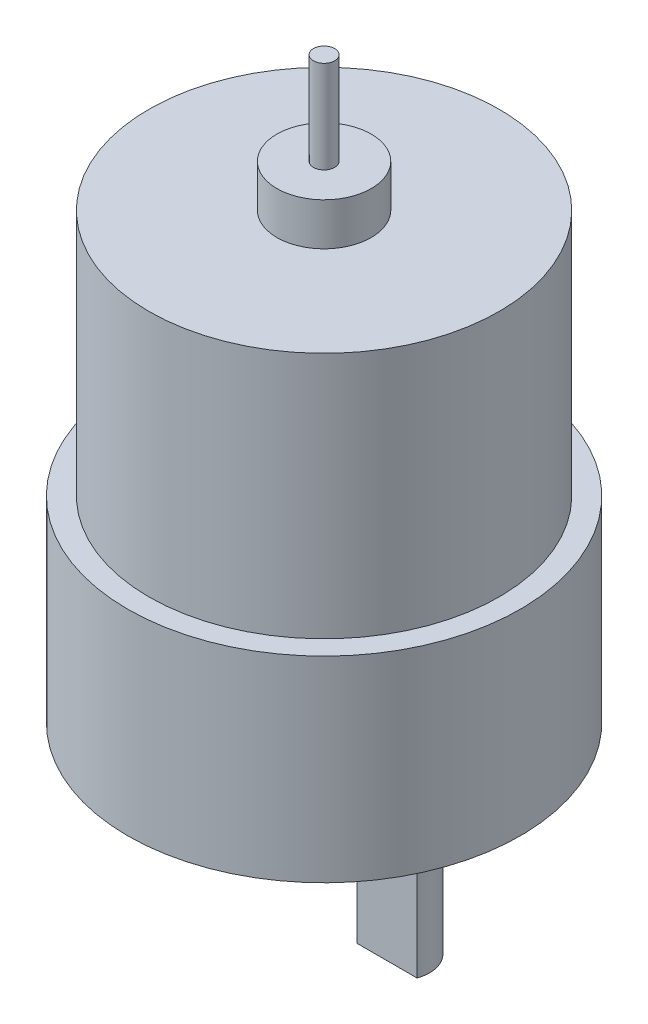
ISO-10303-21;
HEADER;
FILE_DESCRIPTION(('STEP AP214'),'2;1');
FILE_NAME('part.step','',(''),(''),'','','');
FILE_SCHEMA(('AUTOMOTIVE_DESIGN { 1 0 10303 214 1 1 1 1 }'));
ENDSEC;
DATA;
#1=APPLICATION_CONTEXT('core data for automotive mechanical design processes');
#2=APPLICATION_PROTOCOL_DEFINITION('international standard','automotive_design',2000,#1);
#3=PRODUCT_CONTEXT('',#1,'mechanical');
#4=PRODUCT('Part','Part','',(#3));
#5=PRODUCT_RELATED_PRODUCT_CATEGORY('part','',(#4));
#6=PRODUCT_DEFINITION_FORMATION('','',#4);
#7=PRODUCT_DEFINITION_CONTEXT('part definition',#1,'design');
#8=PRODUCT_DEFINITION('design','',#6,#7);
#9=PRODUCT_DEFINITION_SHAPE('','',#8);
#10=(LENGTH_UNIT() NAMED_UNIT(*) SI_UNIT(.MILLI.,.METRE.));
#11=(NAMED_UNIT(*) PLANE_ANGLE_UNIT() SI_UNIT($,.RADIAN.));
#12=(NAMED_UNIT(*) SI_UNIT($,.STERADIAN.) SOLID_ANGLE_UNIT());
#13=UNCERTAINTY_MEASURE_WITH_UNIT(LENGTH_MEASURE(1.E-05),#10,'distance_accuracy_value','');
#14=(GEOMETRIC_REPRESENTATION_CONTEXT(3) GLOBAL_UNCERTAINTY_ASSIGNED_CONTEXT((#13)) GLOBAL_UNIT_ASSIGNED_CONTEXT((#10,
#11,#12)) REPRESENTATION_CONTEXT('',''));
#15=CARTESIAN_POINT('',(0.,0.,0.));
#16=DIRECTION('',(0.,0.,1.));
#17=DIRECTION('',(1.,0.,0.));
#18=AXIS2_PLACEMENT_3D('',#15,#16,#17);
#19=CARTESIAN_POINT('',(0.,36.5374,0.));
#20=DIRECTION('',(0.,1.,0.));
#21=DIRECTION('',(0.,0.,1.));
#22=AXIS2_PLACEMENT_3D('',#19,#20,#21);
#23=PLANE('',#22);
#24=CARTESIAN_POINT('',(0.,36.5374,0.));
#25=DIRECTION('',(0.,1.,0.));
#26=DIRECTION('',(0.,0.,1.));
#27=AXIS2_PLACEMENT_3D('',#24,#25,#26);
#28=CIRCLE('',#27,4.445);
#29=CARTESIAN_POINT('',(0.,36.5374,4.44500000000001));
#30=VERTEX_POINT('',#29);
#31=EDGE_CURVE('E275',#30,#30,#28,.T.);
#32=ORIENTED_EDGE('',*,*,#31,.T.);
#33=EDGE_LOOP('',(#32));
#34=FACE_BOUND('',#33,.T.);
#35=CARTESIAN_POINT('',(0.,36.5374,0.));
#36=DIRECTION('',(0.,1.,0.));
#37=DIRECTION('',(0.,0.,1.));
#38=AXIS2_PLACEMENT_3D('',#35,#36,#37);
#39=CIRCLE('',#38,1.);
#40=CARTESIAN_POINT('',(0.,36.5374,1.00000000000001));
#41=VERTEX_POINT('',#40);
#42=EDGE_CURVE('E272',#41,#41,#39,.T.);
#43=ORIENTED_EDGE('',*,*,#42,.F.);
#44=EDGE_LOOP('',(#43));
#45=FACE_BOUND('',#44,.T.);
#46=ADVANCED_FACE('F34',(#34,#45),#23,.T.);
#47=CARTESIAN_POINT('',(0.,32.5374,0.));
#48=DIRECTION('',(0.,1.,0.));
#49=DIRECTION('',(0.,0.,1.));
#50=AXIS2_PLACEMENT_3D('',#47,#48,#49);
#51=PLANE('',#50);
#52=CARTESIAN_POINT('',(0.,32.5374,0.));
#53=DIRECTION('',(0.,1.,0.));
#54=DIRECTION('',(0.,0.,1.));
#55=AXIS2_PLACEMENT_3D('',#52,#53,#54);
#56=CIRCLE('',#55,16.5);
#57=CARTESIAN_POINT('',(0.,32.5374,16.5));
#58=VERTEX_POINT('',#57);
#59=EDGE_CURVE('E66',#58,#58,#56,.T.);
#60=ORIENTED_EDGE('',*,*,#59,.T.);
#61=EDGE_LOOP('',(#60));
#62=FACE_BOUND('',#61,.T.);
#63=CARTESIAN_POINT('',(0.,32.5374,0.));
#64=DIRECTION('',(0.,1.,0.));
#65=DIRECTION('',(0.,0.,1.));
#66=AXIS2_PLACEMENT_3D('',#63,#64,#65);
#67=CIRCLE('',#66,4.445);
#68=CARTESIAN_POINT('',(0.,32.5374,4.44500000000001));
#69=VERTEX_POINT('',#68);
#70=EDGE_CURVE('E271',#69,#69,#67,.T.);
#71=ORIENTED_EDGE('',*,*,#70,.F.);
#72=EDGE_LOOP('',(#71));
#73=FACE_BOUND('',#72,.T.);
#74=ADVANCED_FACE('F105',(#62,#73),#51,.T.);
#75=CARTESIAN_POINT('',(0.,9.2456,0.));
#76=DIRECTION('',(0.,1.,0.));
#77=DIRECTION('',(0.,0.,1.));
#78=AXIS2_PLACEMENT_3D('',#75,#76,#77);
#79=PLANE('',#78);
#80=CARTESIAN_POINT('',(0.,9.2456,0.));
#81=DIRECTION('',(0.,1.,0.));
#82=DIRECTION('',(0.,0.,1.));
#83=AXIS2_PLACEMENT_3D('',#80,#81,#82);
#84=CIRCLE('',#83,18.5);
#85=CARTESIAN_POINT('',(0.,9.2456,18.5));
#86=VERTEX_POINT('',#85);
#87=EDGE_CURVE('E42',#86,#86,#84,.T.);
#88=ORIENTED_EDGE('',*,*,#87,.T.);
#89=EDGE_LOOP('',(#88));
#90=FACE_BOUND('',#89,.T.);
#91=CARTESIAN_POINT('',(0.,9.2456,0.));
#92=DIRECTION('',(0.,1.,0.));
#93=DIRECTION('',(0.,0.,1.));
#94=AXIS2_PLACEMENT_3D('',#91,#92,#93);
#95=CIRCLE('',#94,16.5);
#96=CARTESIAN_POINT('',(0.,9.2456,16.5));
#97=VERTEX_POINT('',#96);
#98=EDGE_CURVE('E283',#97,#97,#95,.T.);
#99=ORIENTED_EDGE('',*,*,#98,.F.);
#100=EDGE_LOOP('',(#99));
#101=FACE_BOUND('',#100,.T.);
#102=ADVANCED_FACE('F89',(#90,#101),#79,.T.);
#103=CARTESIAN_POINT('',(0.,-13.8176,-6.95));
#104=DIRECTION('',(0.,-1.,0.));
#105=DIRECTION('',(0.,0.,-1.));
#106=AXIS2_PLACEMENT_3D('',#103,#104,#105);
#107=PLANE('',#106);
#108=CARTESIAN_POINT('',(0.,-13.8176,-6.95));
#109=DIRECTION('',(0.,-1.,0.));
#110=DIRECTION('',(0.,0.,-1.));
#111=AXIS2_PLACEMENT_3D('',#108,#109,#110);
#112=CIRCLE('',#111,6.);
#113=CARTESIAN_POINT('',(0.,-13.8176,-12.95));
#114=VERTEX_POINT('',#113);
#115=EDGE_CURVE('E79',#114,#114,#112,.T.);
#116=ORIENTED_EDGE('',*,*,#115,.T.);
#117=EDGE_LOOP('',(#116));
#118=FACE_BOUND('',#117,.T.);
#119=CARTESIAN_POINT('',(0.,-13.8176,-6.95));
#120=DIRECTION('',(0.,-1.,0.));
#121=DIRECTION('',(0.,0.,-1.));
#122=AXIS2_PLACEMENT_3D('',#119,#120,#121);
#123=CIRCLE('',#122,3.);
#124=CARTESIAN_POINT('',(0.,-13.8176,-9.95));
#125=VERTEX_POINT('',#124);
#126=EDGE_CURVE('E73',#125,#125,#123,.T.);
#127=ORIENTED_EDGE('',*,*,#126,.F.);
#128=EDGE_LOOP('',(#127));
#129=FACE_BOUND('',#128,.T.);
#130=ADVANCED_FACE('F102',(#118,#129),#107,.T.);
#131=CARTESIAN_POINT('',(18.5,-9.2456,0.));
#132=DIRECTION('',(0.,-1.,0.));
#133=DIRECTION('',(0.,0.,-1.));
#134=AXIS2_PLACEMENT_3D('',#131,#132,#133);
#135=PLANE('',#134);
#136=CARTESIAN_POINT('',(-13.8545119004604,-9.2456,-6.95));
#137=DIRECTION('',(0.,-1.,0.));
#138=DIRECTION('',(0.,0.,-1.));
#139=AXIS2_PLACEMENT_3D('',#136,#137,#138);
#140=CIRCLE('',#139,1.49999999999999);
#141=CARTESIAN_POINT('',(-13.8545119004604,-9.2456,-8.44999999999999));
#142=VERTEX_POINT('',#141);
#143=EDGE_CURVE('E335',#142,#142,#140,.T.);
#144=ORIENTED_EDGE('',*,*,#143,.F.);
#145=EDGE_LOOP('',(#144));
#146=FACE_BOUND('',#145,.T.);
#147=CARTESIAN_POINT('',(13.8545119004604,-9.2456,-6.95));
#148=DIRECTION('',(0.,-1.,0.));
#149=DIRECTION('',(0.,0.,-1.));
#150=AXIS2_PLACEMENT_3D('',#147,#148,#149);
#151=CIRCLE('',#150,1.49999999999999);
#152=CARTESIAN_POINT('',(13.8545119004604,-9.2456,-8.44999999999999));
#153=VERTEX_POINT('',#152);
#154=EDGE_CURVE('E329',#153,#153,#151,.T.);
#155=ORIENTED_EDGE('',*,*,#154,.F.);
#156=EDGE_LOOP('',(#155));
#157=FACE_BOUND('',#156,.T.);
#158=CARTESIAN_POINT('',(0.,-9.2456,15.5));
#159=DIRECTION('',(0.,-1.,0.));
#160=DIRECTION('',(0.,0.,-1.));
#161=AXIS2_PLACEMENT_3D('',#158,#159,#160);
#162=CIRCLE('',#161,1.49999999999999);
#163=CARTESIAN_POINT('',(0.,-9.2456,14.));
#164=VERTEX_POINT('',#163);
#165=EDGE_CURVE('E323',#164,#164,#162,.T.);
#166=ORIENTED_EDGE('',*,*,#165,.F.);
#167=EDGE_LOOP('',(#166));
#168=FACE_BOUND('',#167,.T.);
#169=CARTESIAN_POINT('',(-15.5,-9.2456,0.));
#170=DIRECTION('',(0.,-1.,0.));
#171=DIRECTION('',(0.,0.,-1.));
#172=AXIS2_PLACEMENT_3D('',#169,#170,#171);
#173=CIRCLE('',#172,1.49999999999999);
#174=CARTESIAN_POINT('',(-15.5,-9.2456,-1.49999999999999));
#175=VERTEX_POINT('',#174);
#176=EDGE_CURVE('E317',#175,#175,#173,.T.);
#177=ORIENTED_EDGE('',*,*,#176,.F.);
#178=EDGE_LOOP('',(#177));
#179=FACE_BOUND('',#178,.T.);
#180=CARTESIAN_POINT('',(-7.75,-9.2456,13.4233937586588));
#181=DIRECTION('',(0.,-1.,0.));
#182=DIRECTION('',(0.,0.,-1.));
#183=AXIS2_PLACEMENT_3D('',#180,#181,#182);
#184=CIRCLE('',#183,1.49999999999999);
#185=CARTESIAN_POINT('',(-7.75,-9.2456,11.9233937586588));
#186=VERTEX_POINT('',#185);
#187=EDGE_CURVE('E311',#186,#186,#184,.T.);
#188=ORIENTED_EDGE('',*,*,#187,.F.);
#189=EDGE_LOOP('',(#188));
#190=FACE_BOUND('',#189,.T.);
#191=CARTESIAN_POINT('',(15.5,-9.2456,0.));
#192=DIRECTION('',(0.,-1.,0.));
#193=DIRECTION('',(0.,0.,-1.));
#194=AXIS2_PLACEMENT_3D('',#191,#192,#193);
#195=CIRCLE('',#194,1.49999999999999);
#196=CARTESIAN_POINT('',(15.5,-9.2456,-1.49999999999998));
#197=VERTEX_POINT('',#196);
#198=EDGE_CURVE('E305',#197,#197,#195,.T.);
#199=ORIENTED_EDGE('',*,*,#198,.F.);
#200=EDGE_LOOP('',(#199));
#201=FACE_BOUND('',#200,.T.);
#202=CARTESIAN_POINT('',(-7.74999999999999,-9.2456,-13.4233937586588));
#203=DIRECTION('',(0.,-1.,0.));
#204=DIRECTION('',(0.,0.,-1.));
#205=AXIS2_PLACEMENT_3D('',#202,#203,#204);
#206=CIRCLE('',#205,1.49999999999999);
#207=CARTESIAN_POINT('',(-7.74999999999999,-9.2456,-14.9233937586588));
#208=VERTEX_POINT('',#207);
#209=EDGE_CURVE('E299',#208,#208,#206,.T.);
#210=ORIENTED_EDGE('',*,*,#209,.F.);
#211=EDGE_LOOP('',(#210));
#212=FACE_BOUND('',#211,.T.);
#213=CARTESIAN_POINT('',(0.,-9.2456,0.));
#214=DIRECTION('',(0.,1.,0.));
#215=DIRECTION('',(0.,0.,1.));
#216=AXIS2_PLACEMENT_3D('',#213,#214,#215);
#217=CIRCLE('',#216,18.5);
#218=CARTESIAN_POINT('',(0.,-9.2456,18.5));
#219=VERTEX_POINT('',#218);
#220=EDGE_CURVE('E11',#219,#219,#217,.T.);
#221=ORIENTED_EDGE('',*,*,#220,.F.);
#222=EDGE_LOOP('',(#221));
#223=FACE_BOUND('',#222,.T.);
#224=CARTESIAN_POINT('',(0.,-9.2456,-6.95));
#225=DIRECTION('',(0.,-1.,0.));
#226=DIRECTION('',(0.,0.,-1.));
#227=AXIS2_PLACEMENT_3D('',#224,#225,#226);
#228=CIRCLE('',#227,6.);
#229=CARTESIAN_POINT('',(0.,-9.2456,-12.95));
#230=VERTEX_POINT('',#229);
#231=EDGE_CURVE('E76',#230,#230,#228,.T.);
#232=ORIENTED_EDGE('',*,*,#231,.F.);
#233=EDGE_LOOP('',(#232));
#234=FACE_BOUND('',#233,.T.);
#235=ADVANCED_FACE('F94',(#146,#157,#168,#179,#190,#201,#212,#223,#234),#135,.T.);
#236=CARTESIAN_POINT('',(0.,-9.2456,0.));
#237=DIRECTION('',(0.,1.,0.));
#238=DIRECTION('',(0.,0.,1.));
#239=AXIS2_PLACEMENT_3D('',#236,#237,#238);
#240=CYLINDRICAL_SURFACE('',#239,18.5);
#241=ORIENTED_EDGE('',*,*,#220,.T.);
#242=EDGE_LOOP('',(#241));
#243=FACE_BOUND('',#242,.T.);
#244=ORIENTED_EDGE('',*,*,#87,.F.);
#245=EDGE_LOOP('',(#244));
#246=FACE_BOUND('',#245,.T.);
#247=ADVANCED_FACE('F36',(#243,#246),#240,.T.);
#248=CARTESIAN_POINT('',(0.,-13.8176,-6.95));
#249=DIRECTION('',(0.,1.,0.));
#250=DIRECTION('',(0.,0.,1.));
#251=AXIS2_PLACEMENT_3D('',#248,#249,#250);
#252=CYLINDRICAL_SURFACE('',#251,6.);
#253=ORIENTED_EDGE('',*,*,#115,.F.);
#254=EDGE_LOOP('',(#253));
#255=FACE_BOUND('',#254,.T.);
#256=ORIENTED_EDGE('',*,*,#231,.T.);
#257=EDGE_LOOP('',(#256));
#258=FACE_BOUND('',#257,.T.);
#259=ADVANCED_FACE('F93',(#255,#258),#252,.T.);
#260=CARTESIAN_POINT('',(0.,-31.6476,-6.95));
#261=DIRECTION('',(0.,1.,0.));
#262=DIRECTION('',(0.,0.,1.));
#263=AXIS2_PLACEMENT_3D('',#260,#261,#262);
#264=CYLINDRICAL_SURFACE('',#263,3.);
#265=CARTESIAN_POINT('',(0.,-31.6476,-6.95));
#266=DIRECTION('',(0.,-1.,0.));
#267=DIRECTION('',(0.,0.,-1.));
#268=AXIS2_PLACEMENT_3D('',#265,#266,#267);
#269=CIRCLE('',#268,3.);
#270=CARTESIAN_POINT('',(-2.82166169907503,-31.6476,-5.93106660866718));
#271=VERTEX_POINT('',#270);
#272=CARTESIAN_POINT('',(2.82166169907508,-31.6476,-5.93106660866718));
#273=VERTEX_POINT('',#272);
#274=EDGE_CURVE('E72',#271,#273,#269,.T.);
#275=ORIENTED_EDGE('',*,*,#274,.F.);
#276=DIRECTION('',(0.,-1.,0.));
#277=VECTOR('',#276,1.);
#278=CARTESIAN_POINT('',(-2.82166169907503,-19.6676,-5.93106660866718));
#279=LINE('',#278,#277);
#280=CARTESIAN_POINT('',(-2.82166169907503,-19.6676,-5.93106660866718));
#281=VERTEX_POINT('',#280);
#282=EDGE_CURVE('E49',#281,#271,#279,.T.);
#283=ORIENTED_EDGE('',*,*,#282,.F.);
#284=CARTESIAN_POINT('',(0.,-19.6676,-6.95));
#285=DIRECTION('',(0.,-1.,0.));
#286=DIRECTION('',(0.,0.,-1.));
#287=AXIS2_PLACEMENT_3D('',#284,#285,#286);
#288=CIRCLE('',#287,3.00000000000002);
#289=CARTESIAN_POINT('',(2.82166169907508,-19.6676,-5.93106660866718));
#290=VERTEX_POINT('',#289);
#291=EDGE_CURVE('E65',#290,#281,#288,.T.);
#292=ORIENTED_EDGE('',*,*,#291,.F.);
#293=DIRECTION('',(0.,-1.,0.));
#294=VECTOR('',#293,1.);
#295=CARTESIAN_POINT('',(2.82166169907508,-19.6676,-5.93106660866718));
#296=LINE('',#295,#294);
#297=EDGE_CURVE('E55',#290,#273,#296,.T.);
#298=ORIENTED_EDGE('',*,*,#297,.T.);
#299=EDGE_LOOP('',(#275,#283,#292,#298));
#300=FACE_BOUND('',#299,.T.);
#301=ORIENTED_EDGE('',*,*,#126,.T.);
#302=EDGE_LOOP('',(#301));
#303=FACE_BOUND('',#302,.T.);
#304=ADVANCED_FACE('F70',(#300,#303),#264,.T.);
#305=CARTESIAN_POINT('',(0.,-31.6476,-6.95));
#306=DIRECTION('',(0.,-1.,0.));
#307=DIRECTION('',(0.,0.,-1.));
#308=AXIS2_PLACEMENT_3D('',#305,#306,#307);
#309=PLANE('',#308);
#310=DIRECTION('',(1.,0.,0.));
#311=VECTOR('',#310,1.);
#312=CARTESIAN_POINT('',(-2.82166169907503,-31.6476,-5.93106660866718));
#313=LINE('',#312,#311);
#314=EDGE_CURVE('E60',#271,#273,#313,.T.);
#315=ORIENTED_EDGE('',*,*,#314,.F.);
#316=ORIENTED_EDGE('',*,*,#274,.T.);
#317=EDGE_LOOP('',(#315,#316));
#318=FACE_BOUND('',#317,.T.);
#319=ADVANCED_FACE('F75',(#318),#309,.T.);
#320=CARTESIAN_POINT('',(-2.82166169907503,-19.6676,-5.93106660866718));
#321=DIRECTION('',(0.,0.,-1.));
#322=DIRECTION('',(-1.,0.,0.));
#323=AXIS2_PLACEMENT_3D('',#320,#321,#322);
#324=PLANE('',#323);
#325=ORIENTED_EDGE('',*,*,#314,.T.);
#326=ORIENTED_EDGE('',*,*,#297,.F.);
#327=DIRECTION('',(1.,0.,0.));
#328=VECTOR('',#327,1.);
#329=CARTESIAN_POINT('',(-2.82166169907503,-19.6676,-5.93106660866718));
#330=LINE('',#329,#328);
#331=EDGE_CURVE('E290',#281,#290,#330,.T.);
#332=ORIENTED_EDGE('',*,*,#331,.F.);
#333=ORIENTED_EDGE('',*,*,#282,.T.);
#334=EDGE_LOOP('',(#325,#326,#332,#333));
#335=FACE_BOUND('',#334,.T.);
#336=ADVANCED_FACE('F61',(#335),#324,.F.);
#337=CARTESIAN_POINT('',(0.,-19.6676,-6.95));
#338=DIRECTION('',(0.,-1.,0.));
#339=DIRECTION('',(0.,0.,-1.));
#340=AXIS2_PLACEMENT_3D('',#337,#338,#339);
#341=PLANE('',#340);
#342=ORIENTED_EDGE('',*,*,#291,.T.);
#343=ORIENTED_EDGE('',*,*,#331,.T.);
#344=EDGE_LOOP('',(#342,#343));
#345=FACE_BOUND('',#344,.T.);
#346=ADVANCED_FACE('F126',(#345),#341,.T.);
#347=CARTESIAN_POINT('',(0.,32.5374,0.));
#348=DIRECTION('',(0.,-1.,0.));
#349=DIRECTION('',(0.,0.,-1.));
#350=AXIS2_PLACEMENT_3D('',#347,#348,#349);
#351=CYLINDRICAL_SURFACE('',#350,16.5);
#352=ORIENTED_EDGE('',*,*,#59,.F.);
#353=EDGE_LOOP('',(#352));
#354=FACE_BOUND('',#353,.T.);
#355=ORIENTED_EDGE('',*,*,#98,.T.);
#356=EDGE_LOOP('',(#355));
#357=FACE_BOUND('',#356,.T.);
#358=ADVANCED_FACE('F121',(#354,#357),#351,.T.);
#359=CARTESIAN_POINT('',(0.,36.5374,0.));
#360=DIRECTION('',(0.,-1.,0.));
#361=DIRECTION('',(0.,0.,-1.));
#362=AXIS2_PLACEMENT_3D('',#359,#360,#361);
#363=CYLINDRICAL_SURFACE('',#362,4.445);
#364=ORIENTED_EDGE('',*,*,#31,.F.);
#365=EDGE_LOOP('',(#364));
#366=FACE_BOUND('',#365,.T.);
#367=ORIENTED_EDGE('',*,*,#70,.T.);
#368=EDGE_LOOP('',(#367));
#369=FACE_BOUND('',#368,.T.);
#370=ADVANCED_FACE('F119',(#366,#369),#363,.T.);
#371=CARTESIAN_POINT('',(0.,45.2374,0.));
#372=DIRECTION('',(0.,-1.,0.));
#373=DIRECTION('',(0.,0.,-1.));
#374=AXIS2_PLACEMENT_3D('',#371,#372,#373);
#375=CYLINDRICAL_SURFACE('',#374,1.);
#376=CARTESIAN_POINT('',(0.,45.2374,0.));
#377=DIRECTION('',(0.,1.,0.));
#378=DIRECTION('',(0.,0.,1.));
#379=AXIS2_PLACEMENT_3D('',#376,#377,#378);
#380=CIRCLE('',#379,1.);
#381=CARTESIAN_POINT('',(0.,45.2374,1.00000000000001));
#382=VERTEX_POINT('',#381);
#383=EDGE_CURVE('E270',#382,#382,#380,.T.);
#384=ORIENTED_EDGE('',*,*,#383,.F.);
#385=EDGE_LOOP('',(#384));
#386=FACE_BOUND('',#385,.T.);
#387=ORIENTED_EDGE('',*,*,#42,.T.);
#388=EDGE_LOOP('',(#387));
#389=FACE_BOUND('',#388,.T.);
#390=ADVANCED_FACE('F117',(#386,#389),#375,.T.);
#391=CARTESIAN_POINT('',(0.,45.2374,0.));
#392=DIRECTION('',(0.,1.,0.));
#393=DIRECTION('',(0.,0.,1.));
#394=AXIS2_PLACEMENT_3D('',#391,#392,#393);
#395=PLANE('',#394);
#396=ORIENTED_EDGE('',*,*,#383,.T.);
#397=EDGE_LOOP('',(#396));
#398=FACE_BOUND('',#397,.T.);
#399=ADVANCED_FACE('F260',(#398),#395,.T.);
#400=CARTESIAN_POINT('',(-7.74999999999999,-3.2456,-13.4233937586588));
#401=DIRECTION('',(0.,1.,0.));
#402=DIRECTION('',(0.,0.,1.));
#403=AXIS2_PLACEMENT_3D('',#400,#401,#402);
#404=PLANE('',#403);
#405=CARTESIAN_POINT('',(-7.74999999999999,-3.24559999999999,-13.4233937586588));
#406=DIRECTION('',(0.,-1.,0.));
#407=DIRECTION('',(0.,0.,-1.));
#408=AXIS2_PLACEMENT_3D('',#405,#406,#407);
#409=CIRCLE('',#408,1.49999999999999);
#410=CARTESIAN_POINT('',(-7.74999999999999,-3.24559999999999,-14.9233937586588));
#411=VERTEX_POINT('',#410);
#412=EDGE_CURVE('E278',#411,#411,#409,.T.);
#413=ORIENTED_EDGE('',*,*,#412,.T.);
#414=EDGE_LOOP('',(#413));
#415=FACE_BOUND('',#414,.T.);
#416=ADVANCED_FACE('F257',(#415),#404,.F.);
#417=CARTESIAN_POINT('',(-7.74999999999999,-9.2456,-13.4233937586588));
#418=DIRECTION('',(0.,-1.,0.));
#419=DIRECTION('',(0.,0.,-1.));
#420=AXIS2_PLACEMENT_3D('',#417,#418,#419);
#421=CYLINDRICAL_SURFACE('',#420,1.49999999999999);
#422=ORIENTED_EDGE('',*,*,#412,.F.);
#423=EDGE_LOOP('',(#422));
#424=FACE_BOUND('',#423,.T.);
#425=ORIENTED_EDGE('',*,*,#209,.T.);
#426=EDGE_LOOP('',(#425));
#427=FACE_BOUND('',#426,.T.);
#428=ADVANCED_FACE('F253',(#424,#427),#421,.F.);
#429=CARTESIAN_POINT('',(15.5,-3.2456,0.));
#430=DIRECTION('',(0.,1.,0.));
#431=DIRECTION('',(0.,0.,1.));
#432=AXIS2_PLACEMENT_3D('',#429,#430,#431);
#433=PLANE('',#432);
#434=CARTESIAN_POINT('',(15.5,-3.24559999999999,0.));
#435=DIRECTION('',(0.,-1.,0.));
#436=DIRECTION('',(0.,0.,-1.));
#437=AXIS2_PLACEMENT_3D('',#434,#435,#436);
#438=CIRCLE('',#437,1.49999999999999);
#439=CARTESIAN_POINT('',(15.5,-3.24559999999999,-1.49999999999998));
#440=VERTEX_POINT('',#439);
#441=EDGE_CURVE('E302',#440,#440,#438,.T.);
#442=ORIENTED_EDGE('',*,*,#441,.T.);
#443=EDGE_LOOP('',(#442));
#444=FACE_BOUND('',#443,.T.);
#445=ADVANCED_FACE('F249',(#444),#433,.F.);
#446=CARTESIAN_POINT('',(15.5,-9.2456,0.));
#447=DIRECTION('',(0.,-1.,0.));
#448=DIRECTION('',(0.,0.,-1.));
#449=AXIS2_PLACEMENT_3D('',#446,#447,#448);
#450=CYLINDRICAL_SURFACE('',#449,1.49999999999999);
#451=ORIENTED_EDGE('',*,*,#441,.F.);
#452=EDGE_LOOP('',(#451));
#453=FACE_BOUND('',#452,.T.);
#454=ORIENTED_EDGE('',*,*,#198,.T.);
#455=EDGE_LOOP('',(#454));
#456=FACE_BOUND('',#455,.T.);
#457=ADVANCED_FACE('F245',(#453,#456),#450,.F.);
#458=CARTESIAN_POINT('',(-7.75,-3.2456,13.4233937586588));
#459=DIRECTION('',(0.,1.,0.));
#460=DIRECTION('',(0.,0.,1.));
#461=AXIS2_PLACEMENT_3D('',#458,#459,#460);
#462=PLANE('',#461);
#463=CARTESIAN_POINT('',(-7.75,-3.24559999999999,13.4233937586588));
#464=DIRECTION('',(0.,-1.,0.));
#465=DIRECTION('',(0.,0.,-1.));
#466=AXIS2_PLACEMENT_3D('',#463,#464,#465);
#467=CIRCLE('',#466,1.49999999999999);
#468=CARTESIAN_POINT('',(-7.75,-3.24559999999999,11.9233937586588));
#469=VERTEX_POINT('',#468);
#470=EDGE_CURVE('E308',#469,#469,#467,.T.);
#471=ORIENTED_EDGE('',*,*,#470,.T.);
#472=EDGE_LOOP('',(#471));
#473=FACE_BOUND('',#472,.T.);
#474=ADVANCED_FACE('F241',(#473),#462,.F.);
#475=CARTESIAN_POINT('',(-7.75,-9.2456,13.4233937586588));
#476=DIRECTION('',(0.,-1.,0.));
#477=DIRECTION('',(0.,0.,-1.));
#478=AXIS2_PLACEMENT_3D('',#475,#476,#477);
#479=CYLINDRICAL_SURFACE('',#478,1.49999999999999);
#480=ORIENTED_EDGE('',*,*,#470,.F.);
#481=EDGE_LOOP('',(#480));
#482=FACE_BOUND('',#481,.T.);
#483=ORIENTED_EDGE('',*,*,#187,.T.);
#484=EDGE_LOOP('',(#483));
#485=FACE_BOUND('',#484,.T.);
#486=ADVANCED_FACE('F237',(#482,#485),#479,.F.);
#487=CARTESIAN_POINT('',(-15.5,-3.2456,0.));
#488=DIRECTION('',(0.,1.,0.));
#489=DIRECTION('',(0.,0.,1.));
#490=AXIS2_PLACEMENT_3D('',#487,#488,#489);
#491=PLANE('',#490);
#492=CARTESIAN_POINT('',(-15.5,-3.24559999999999,0.));
#493=DIRECTION('',(0.,-1.,0.));
#494=DIRECTION('',(0.,0.,-1.));
#495=AXIS2_PLACEMENT_3D('',#492,#493,#494);
#496=CIRCLE('',#495,1.49999999999999);
#497=CARTESIAN_POINT('',(-15.5,-3.24559999999999,-1.49999999999999));
#498=VERTEX_POINT('',#497);
#499=EDGE_CURVE('E314',#498,#498,#496,.T.);
#500=ORIENTED_EDGE('',*,*,#499,.T.);
#501=EDGE_LOOP('',(#500));
#502=FACE_BOUND('',#501,.T.);
#503=ADVANCED_FACE('F233',(#502),#491,.F.);
#504=CARTESIAN_POINT('',(-15.5,-9.2456,0.));
#505=DIRECTION('',(0.,-1.,0.));
#506=DIRECTION('',(0.,0.,-1.));
#507=AXIS2_PLACEMENT_3D('',#504,#505,#506);
#508=CYLINDRICAL_SURFACE('',#507,1.49999999999999);
#509=ORIENTED_EDGE('',*,*,#499,.F.);
#510=EDGE_LOOP('',(#509));
#511=FACE_BOUND('',#510,.T.);
#512=ORIENTED_EDGE('',*,*,#176,.T.);
#513=EDGE_LOOP('',(#512));
#514=FACE_BOUND('',#513,.T.);
#515=ADVANCED_FACE('F165',(#511,#514),#508,.F.);
#516=CARTESIAN_POINT('',(0.,0.754399999999995,15.5));
#517=DIRECTION('',(0.,1.,0.));
#518=DIRECTION('',(0.,0.,1.));
#519=AXIS2_PLACEMENT_3D('',#516,#517,#518);
#520=PLANE('',#519);
#521=CARTESIAN_POINT('',(0.,0.754399999999995,15.5));
#522=DIRECTION('',(0.,-1.,0.));
#523=DIRECTION('',(0.,0.,-1.));
#524=AXIS2_PLACEMENT_3D('',#521,#522,#523);
#525=CIRCLE('',#524,1.49999999999999);
#526=CARTESIAN_POINT('',(0.,0.754399999999995,14.));
#527=VERTEX_POINT('',#526);
#528=EDGE_CURVE('E320',#527,#527,#525,.T.);
#529=ORIENTED_EDGE('',*,*,#528,.T.);
#530=EDGE_LOOP('',(#529));
#531=FACE_BOUND('',#530,.T.);
#532=ADVANCED_FACE('F170',(#531),#520,.F.);
#533=CARTESIAN_POINT('',(0.,-9.2456,15.5));
#534=DIRECTION('',(0.,-1.,0.));
#535=DIRECTION('',(0.,0.,-1.));
#536=AXIS2_PLACEMENT_3D('',#533,#534,#535);
#537=CYLINDRICAL_SURFACE('',#536,1.49999999999999);
#538=ORIENTED_EDGE('',*,*,#528,.F.);
#539=EDGE_LOOP('',(#538));
#540=FACE_BOUND('',#539,.T.);
#541=ORIENTED_EDGE('',*,*,#165,.T.);
#542=EDGE_LOOP('',(#541));
#543=FACE_BOUND('',#542,.T.);
#544=ADVANCED_FACE('F175',(#540,#543),#537,.F.);
#545=CARTESIAN_POINT('',(13.8545119004604,0.754399999999995,-6.95));
#546=DIRECTION('',(0.,1.,0.));
#547=DIRECTION('',(0.,0.,1.));
#548=AXIS2_PLACEMENT_3D('',#545,#546,#547);
#549=PLANE('',#548);
#550=CARTESIAN_POINT('',(13.8545119004604,0.754399999999995,-6.95));
#551=DIRECTION('',(0.,-1.,0.));
#552=DIRECTION('',(0.,0.,-1.));
#553=AXIS2_PLACEMENT_3D('',#550,#551,#552);
#554=CIRCLE('',#553,1.49999999999999);
#555=CARTESIAN_POINT('',(13.8545119004604,0.754399999999995,-8.44999999999999));
#556=VERTEX_POINT('',#555);
#557=EDGE_CURVE('E326',#556,#556,#554,.T.);
#558=ORIENTED_EDGE('',*,*,#557,.T.);
#559=EDGE_LOOP('',(#558));
#560=FACE_BOUND('',#559,.T.);
#561=ADVANCED_FACE('F185',(#560),#549,.F.);
#562=CARTESIAN_POINT('',(13.8545119004604,-9.2456,-6.95));
#563=DIRECTION('',(0.,-1.,0.));
#564=DIRECTION('',(0.,0.,-1.));
#565=AXIS2_PLACEMENT_3D('',#562,#563,#564);
#566=CYLINDRICAL_SURFACE('',#565,1.49999999999999);
#567=ORIENTED_EDGE('',*,*,#557,.F.);
#568=EDGE_LOOP('',(#567));
#569=FACE_BOUND('',#568,.T.);
#570=ORIENTED_EDGE('',*,*,#154,.T.);
#571=EDGE_LOOP('',(#570));
#572=FACE_BOUND('',#571,.T.);
#573=ADVANCED_FACE('F195',(#569,#572),#566,.F.);
#574=CARTESIAN_POINT('',(-13.8545119004604,0.754399999999995,-6.95));
#575=DIRECTION('',(0.,1.,0.));
#576=DIRECTION('',(0.,0.,1.));
#577=AXIS2_PLACEMENT_3D('',#574,#575,#576);
#578=PLANE('',#577);
#579=CARTESIAN_POINT('',(-13.8545119004604,0.754399999999995,-6.95));
#580=DIRECTION('',(0.,-1.,0.));
#581=DIRECTION('',(0.,0.,-1.));
#582=AXIS2_PLACEMENT_3D('',#579,#580,#581);
#583=CIRCLE('',#582,1.49999999999999);
#584=CARTESIAN_POINT('',(-13.8545119004604,0.754399999999995,-8.44999999999999));
#585=VERTEX_POINT('',#584);
#586=EDGE_CURVE('E332',#585,#585,#583,.T.);
#587=ORIENTED_EDGE('',*,*,#586,.T.);
#588=EDGE_LOOP('',(#587));
#589=FACE_BOUND('',#588,.T.);
#590=ADVANCED_FACE('F205',(#589),#578,.F.);
#591=CARTESIAN_POINT('',(-13.8545119004604,-9.2456,-6.95));
#592=DIRECTION('',(0.,-1.,0.));
#593=DIRECTION('',(0.,0.,-1.));
#594=AXIS2_PLACEMENT_3D('',#591,#592,#593);
#595=CYLINDRICAL_SURFACE('',#594,1.49999999999999);
#596=ORIENTED_EDGE('',*,*,#586,.F.);
#597=EDGE_LOOP('',(#596));
#598=FACE_BOUND('',#597,.T.);
#599=ORIENTED_EDGE('',*,*,#143,.T.);
#600=EDGE_LOOP('',(#599));
#601=FACE_BOUND('',#600,.T.);
#602=ADVANCED_FACE('F215',(#598,#601),#595,.F.);
#603=CLOSED_SHELL('',(#46,#74,#102,#130,#235,#247,#259,#304,#319,#336,#346,#358,#370,#390,#399,
#416,#428,#445,#457,#474,#486,#503,#515,#532,#544,#561,#573,#590,#602));
#604=MANIFOLD_SOLID_BREP('B2',#603);
#605=ADVANCED_BREP_SHAPE_REPRESENTATION('',(#18,#604),#14);
#606=SHAPE_DEFINITION_REPRESENTATION(#9,#605);
ENDSEC;
END-ISO-10303-21;
